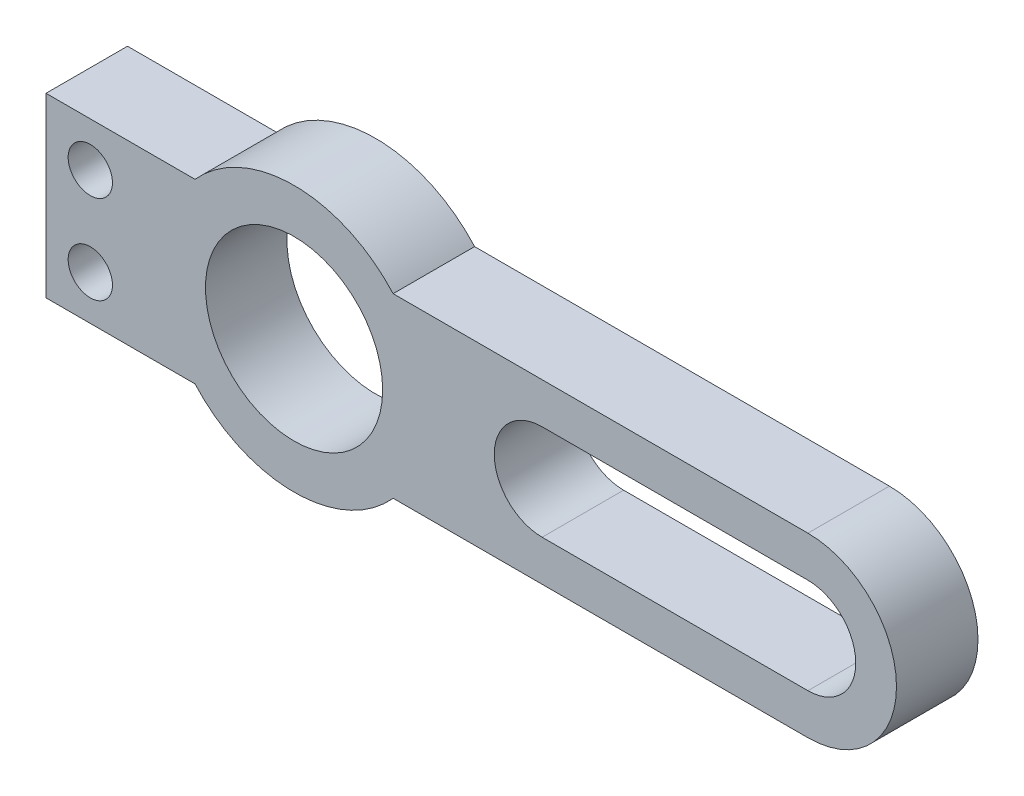
ISO-10303-21;
HEADER;
FILE_DESCRIPTION(('STEP AP214'),'2;1');
FILE_NAME('part.step','',(''),(''),'','','');
FILE_SCHEMA(('AUTOMOTIVE_DESIGN { 1 0 10303 214 1 1 1 1 }'));
ENDSEC;
DATA;
#1=APPLICATION_CONTEXT('core data for automotive mechanical design processes');
#2=APPLICATION_PROTOCOL_DEFINITION('international standard','automotive_design',2000,#1);
#3=PRODUCT_CONTEXT('',#1,'mechanical');
#4=PRODUCT('Part','Part','',(#3));
#5=PRODUCT_RELATED_PRODUCT_CATEGORY('part','',(#4));
#6=PRODUCT_DEFINITION_FORMATION('','',#4);
#7=PRODUCT_DEFINITION_CONTEXT('part definition',#1,'design');
#8=PRODUCT_DEFINITION('design','',#6,#7);
#9=PRODUCT_DEFINITION_SHAPE('','',#8);
#10=(LENGTH_UNIT() NAMED_UNIT(*) SI_UNIT(.MILLI.,.METRE.));
#11=(NAMED_UNIT(*) PLANE_ANGLE_UNIT() SI_UNIT($,.RADIAN.));
#12=(NAMED_UNIT(*) SI_UNIT($,.STERADIAN.) SOLID_ANGLE_UNIT());
#13=UNCERTAINTY_MEASURE_WITH_UNIT(LENGTH_MEASURE(1.E-05),#10,'distance_accuracy_value','');
#14=(GEOMETRIC_REPRESENTATION_CONTEXT(3) GLOBAL_UNCERTAINTY_ASSIGNED_CONTEXT((#13)) GLOBAL_UNIT_ASSIGNED_CONTEXT((#10,
#11,#12)) REPRESENTATION_CONTEXT('',''));
#15=CARTESIAN_POINT('',(0.,0.,0.));
#16=DIRECTION('',(0.,0.,1.));
#17=DIRECTION('',(1.,0.,0.));
#18=AXIS2_PLACEMENT_3D('',#15,#16,#17);
#19=CARTESIAN_POINT('',(-9.525,0.,5.842));
#20=DIRECTION('',(0.,0.,1.));
#21=DIRECTION('',(1.,0.,0.));
#22=AXIS2_PLACEMENT_3D('',#19,#20,#21);
#23=PLANE('',#22);
#24=CARTESIAN_POINT('',(-24.13,3.175,5.842));
#25=DIRECTION('',(0.,0.,1.));
#26=DIRECTION('',(1.,0.,0.));
#27=AXIS2_PLACEMENT_3D('',#24,#25,#26);
#28=CIRCLE('',#27,1.5875);
#29=CARTESIAN_POINT('',(-22.5425,3.175,5.842));
#30=VERTEX_POINT('',#29);
#31=EDGE_CURVE('E262',#30,#30,#28,.T.);
#32=ORIENTED_EDGE('',*,*,#31,.F.);
#33=EDGE_LOOP('',(#32));
#34=FACE_BOUND('',#33,.T.);
#35=CARTESIAN_POINT('',(-24.13,-3.17500000000001,5.842));
#36=DIRECTION('',(0.,0.,1.));
#37=DIRECTION('',(1.,0.,0.));
#38=AXIS2_PLACEMENT_3D('',#35,#36,#37);
#39=CIRCLE('',#38,1.5875);
#40=CARTESIAN_POINT('',(-22.5425,-3.17500000000001,5.842));
#41=VERTEX_POINT('',#40);
#42=EDGE_CURVE('E266',#41,#41,#39,.T.);
#43=ORIENTED_EDGE('',*,*,#42,.F.);
#44=EDGE_LOOP('',(#43));
#45=FACE_BOUND('',#44,.T.);
#46=DIRECTION('',(-1.,0.,0.));
#47=VECTOR('',#46,1.);
#48=CARTESIAN_POINT('',(-9.525,3.429,5.842));
#49=LINE('',#48,#47);
#50=CARTESIAN_POINT('',(27.305,3.429,5.842));
#51=VERTEX_POINT('',#50);
#52=CARTESIAN_POINT('',(8.255,3.429,5.842));
#53=VERTEX_POINT('',#52);
#54=EDGE_CURVE('E117',#51,#53,#49,.T.);
#55=ORIENTED_EDGE('',*,*,#54,.F.);
#56=CARTESIAN_POINT('',(27.305,0.,5.842));
#57=DIRECTION('',(0.,0.,1.));
#58=DIRECTION('',(1.,0.,0.));
#59=AXIS2_PLACEMENT_3D('',#56,#57,#58);
#60=CIRCLE('',#59,3.429);
#61=CARTESIAN_POINT('',(27.305,-3.429,5.842));
#62=VERTEX_POINT('',#61);
#63=EDGE_CURVE('E103',#62,#51,#60,.T.);
#64=ORIENTED_EDGE('',*,*,#63,.F.);
#65=DIRECTION('',(1.,0.,0.));
#66=VECTOR('',#65,1.);
#67=CARTESIAN_POINT('',(-9.525,-3.429,5.842));
#68=LINE('',#67,#66);
#69=CARTESIAN_POINT('',(8.255,-3.429,5.842));
#70=VERTEX_POINT('',#69);
#71=EDGE_CURVE('E59',#70,#62,#68,.T.);
#72=ORIENTED_EDGE('',*,*,#71,.F.);
#73=CARTESIAN_POINT('',(8.255,0.,5.842));
#74=DIRECTION('',(0.,0.,1.));
#75=DIRECTION('',(1.,0.,0.));
#76=AXIS2_PLACEMENT_3D('',#73,#74,#75);
#77=CIRCLE('',#76,3.429);
#78=EDGE_CURVE('E120',#53,#70,#77,.T.);
#79=ORIENTED_EDGE('',*,*,#78,.F.);
#80=EDGE_LOOP('',(#55,#64,#72,#79));
#81=FACE_BOUND('',#80,.T.);
#82=DIRECTION('',(1.,0.,0.));
#83=VECTOR('',#82,1.);
#84=CARTESIAN_POINT('',(-2.42548417143817,-6.35,5.842));
#85=LINE('',#84,#83);
#86=CARTESIAN_POINT('',(-2.42548417143817,-6.35,5.842));
#87=VERTEX_POINT('',#86);
#88=CARTESIAN_POINT('',(27.305,-6.35,5.842));
#89=VERTEX_POINT('',#88);
#90=EDGE_CURVE('E250',#87,#89,#85,.T.);
#91=ORIENTED_EDGE('',*,*,#90,.T.);
#92=CARTESIAN_POINT('',(27.305,0.,5.842));
#93=DIRECTION('',(0.,0.,1.));
#94=DIRECTION('',(1.,0.,0.));
#95=AXIS2_PLACEMENT_3D('',#92,#93,#94);
#96=CIRCLE('',#95,6.35);
#97=CARTESIAN_POINT('',(27.305,6.35,5.842));
#98=VERTEX_POINT('',#97);
#99=EDGE_CURVE('E108',#89,#98,#96,.T.);
#100=ORIENTED_EDGE('',*,*,#99,.T.);
#101=DIRECTION('',(-1.,0.,0.));
#102=VECTOR('',#101,1.);
#103=CARTESIAN_POINT('',(-2.42548417143817,6.35,5.842));
#104=LINE('',#103,#102);
#105=CARTESIAN_POINT('',(-2.42548417143817,6.35,5.842));
#106=VERTEX_POINT('',#105);
#107=EDGE_CURVE('E245',#98,#106,#104,.T.);
#108=ORIENTED_EDGE('',*,*,#107,.T.);
#109=CARTESIAN_POINT('',(-9.525,0.,5.842));
#110=DIRECTION('',(0.,0.,1.));
#111=DIRECTION('',(1.,0.,0.));
#112=AXIS2_PLACEMENT_3D('',#109,#110,#111);
#113=CIRCLE('',#112,9.525);
#114=CARTESIAN_POINT('',(-16.6245158285618,6.35,5.842));
#115=VERTEX_POINT('',#114);
#116=EDGE_CURVE('E281',#106,#115,#113,.T.);
#117=ORIENTED_EDGE('',*,*,#116,.T.);
#118=DIRECTION('',(-1.,0.,0.));
#119=VECTOR('',#118,1.);
#120=CARTESIAN_POINT('',(-27.305,6.35,5.842));
#121=LINE('',#120,#119);
#122=CARTESIAN_POINT('',(-27.305,6.35,5.842));
#123=VERTEX_POINT('',#122);
#124=EDGE_CURVE('E224',#115,#123,#121,.T.);
#125=ORIENTED_EDGE('',*,*,#124,.T.);
#126=DIRECTION('',(0.,-1.,0.));
#127=VECTOR('',#126,1.);
#128=CARTESIAN_POINT('',(-27.305,-6.35,5.842));
#129=LINE('',#128,#127);
#130=CARTESIAN_POINT('',(-27.305,-6.35,5.842));
#131=VERTEX_POINT('',#130);
#132=EDGE_CURVE('E277',#123,#131,#129,.T.);
#133=ORIENTED_EDGE('',*,*,#132,.T.);
#134=DIRECTION('',(1.,0.,0.));
#135=VECTOR('',#134,1.);
#136=CARTESIAN_POINT('',(-27.305,-6.35,5.842));
#137=LINE('',#136,#135);
#138=CARTESIAN_POINT('',(-16.6245158285618,-6.35,5.842));
#139=VERTEX_POINT('',#138);
#140=EDGE_CURVE('E274',#131,#139,#137,.T.);
#141=ORIENTED_EDGE('',*,*,#140,.T.);
#142=CARTESIAN_POINT('',(-9.525,0.,5.842));
#143=DIRECTION('',(0.,0.,1.));
#144=DIRECTION('',(1.,0.,0.));
#145=AXIS2_PLACEMENT_3D('',#142,#143,#144);
#146=CIRCLE('',#145,9.525);
#147=EDGE_CURVE('E271',#139,#87,#146,.T.);
#148=ORIENTED_EDGE('',*,*,#147,.T.);
#149=EDGE_LOOP('',(#91,#100,#108,#117,#125,#133,#141,#148));
#150=FACE_BOUND('',#149,.T.);
#151=CARTESIAN_POINT('',(-9.525,0.,5.842));
#152=DIRECTION('',(0.,0.,1.));
#153=DIRECTION('',(1.,0.,0.));
#154=AXIS2_PLACEMENT_3D('',#151,#152,#153);
#155=CIRCLE('',#154,6.35);
#156=CARTESIAN_POINT('',(-3.175,0.,5.842));
#157=VERTEX_POINT('',#156);
#158=EDGE_CURVE('E126',#157,#157,#155,.T.);
#159=ORIENTED_EDGE('',*,*,#158,.F.);
#160=EDGE_LOOP('',(#159));
#161=FACE_BOUND('',#160,.T.);
#162=ADVANCED_FACE('F40',(#34,#45,#81,#150,#161),#23,.T.);
#163=CARTESIAN_POINT('',(-9.525,0.,0.));
#164=DIRECTION('',(0.,0.,1.));
#165=DIRECTION('',(1.,0.,0.));
#166=AXIS2_PLACEMENT_3D('',#163,#164,#165);
#167=PLANE('',#166);
#168=CARTESIAN_POINT('',(-24.13,3.175,0.));
#169=DIRECTION('',(0.,0.,1.));
#170=DIRECTION('',(1.,0.,0.));
#171=AXIS2_PLACEMENT_3D('',#168,#169,#170);
#172=CIRCLE('',#171,1.5875);
#173=CARTESIAN_POINT('',(-22.5425,3.175,0.));
#174=VERTEX_POINT('',#173);
#175=EDGE_CURVE('E95',#174,#174,#172,.T.);
#176=ORIENTED_EDGE('',*,*,#175,.T.);
#177=EDGE_LOOP('',(#176));
#178=FACE_BOUND('',#177,.T.);
#179=CARTESIAN_POINT('',(-24.13,-3.17500000000001,0.));
#180=DIRECTION('',(0.,0.,1.));
#181=DIRECTION('',(1.,0.,0.));
#182=AXIS2_PLACEMENT_3D('',#179,#180,#181);
#183=CIRCLE('',#182,1.5875);
#184=CARTESIAN_POINT('',(-22.5425,-3.17500000000001,0.));
#185=VERTEX_POINT('',#184);
#186=EDGE_CURVE('E265',#185,#185,#183,.T.);
#187=ORIENTED_EDGE('',*,*,#186,.T.);
#188=EDGE_LOOP('',(#187));
#189=FACE_BOUND('',#188,.T.);
#190=DIRECTION('',(-1.,0.,0.));
#191=VECTOR('',#190,1.);
#192=CARTESIAN_POINT('',(-2.42548417143817,6.35,0.));
#193=LINE('',#192,#191);
#194=CARTESIAN_POINT('',(27.305,6.35,0.));
#195=VERTEX_POINT('',#194);
#196=CARTESIAN_POINT('',(-2.42548417143817,6.35,0.));
#197=VERTEX_POINT('',#196);
#198=EDGE_CURVE('E218',#195,#197,#193,.T.);
#199=ORIENTED_EDGE('',*,*,#198,.F.);
#200=CARTESIAN_POINT('',(27.305,0.,0.));
#201=DIRECTION('',(0.,0.,1.));
#202=DIRECTION('',(1.,0.,0.));
#203=AXIS2_PLACEMENT_3D('',#200,#201,#202);
#204=CIRCLE('',#203,6.35);
#205=CARTESIAN_POINT('',(27.305,-6.35,0.));
#206=VERTEX_POINT('',#205);
#207=EDGE_CURVE('E107',#195,#206,#204,.F.);
#208=ORIENTED_EDGE('',*,*,#207,.T.);
#209=DIRECTION('',(1.,0.,0.));
#210=VECTOR('',#209,1.);
#211=CARTESIAN_POINT('',(-2.42548417143817,-6.35,0.));
#212=LINE('',#211,#210);
#213=CARTESIAN_POINT('',(-2.42548417143817,-6.35,0.));
#214=VERTEX_POINT('',#213);
#215=EDGE_CURVE('E242',#214,#206,#212,.T.);
#216=ORIENTED_EDGE('',*,*,#215,.F.);
#217=CARTESIAN_POINT('',(-9.525,0.,0.));
#218=DIRECTION('',(0.,0.,1.));
#219=DIRECTION('',(1.,0.,0.));
#220=AXIS2_PLACEMENT_3D('',#217,#218,#219);
#221=CIRCLE('',#220,9.525);
#222=CARTESIAN_POINT('',(-16.6245158285618,-6.35,0.));
#223=VERTEX_POINT('',#222);
#224=EDGE_CURVE('E239',#223,#214,#221,.T.);
#225=ORIENTED_EDGE('',*,*,#224,.F.);
#226=DIRECTION('',(1.,0.,0.));
#227=VECTOR('',#226,1.);
#228=CARTESIAN_POINT('',(-27.305,-6.35,0.));
#229=LINE('',#228,#227);
#230=CARTESIAN_POINT('',(-27.305,-6.35,0.));
#231=VERTEX_POINT('',#230);
#232=EDGE_CURVE('E233',#231,#223,#229,.T.);
#233=ORIENTED_EDGE('',*,*,#232,.F.);
#234=DIRECTION('',(0.,-1.,0.));
#235=VECTOR('',#234,1.);
#236=CARTESIAN_POINT('',(-27.305,-6.35,0.));
#237=LINE('',#236,#235);
#238=CARTESIAN_POINT('',(-27.305,6.35,0.));
#239=VERTEX_POINT('',#238);
#240=EDGE_CURVE('E231',#239,#231,#237,.T.);
#241=ORIENTED_EDGE('',*,*,#240,.F.);
#242=DIRECTION('',(-1.,0.,0.));
#243=VECTOR('',#242,1.);
#244=CARTESIAN_POINT('',(-27.305,6.35,0.));
#245=LINE('',#244,#243);
#246=CARTESIAN_POINT('',(-16.6245158285618,6.35,0.));
#247=VERTEX_POINT('',#246);
#248=EDGE_CURVE('E217',#247,#239,#245,.T.);
#249=ORIENTED_EDGE('',*,*,#248,.F.);
#250=CARTESIAN_POINT('',(-9.525,0.,0.));
#251=DIRECTION('',(0.,0.,1.));
#252=DIRECTION('',(1.,0.,0.));
#253=AXIS2_PLACEMENT_3D('',#250,#251,#252);
#254=CIRCLE('',#253,9.525);
#255=EDGE_CURVE('E204',#197,#247,#254,.T.);
#256=ORIENTED_EDGE('',*,*,#255,.F.);
#257=EDGE_LOOP('',(#199,#208,#216,#225,#233,#241,#249,#256));
#258=FACE_BOUND('',#257,.T.);
#259=CARTESIAN_POINT('',(-9.525,0.,0.));
#260=DIRECTION('',(0.,0.,1.));
#261=DIRECTION('',(1.,0.,0.));
#262=AXIS2_PLACEMENT_3D('',#259,#260,#261);
#263=CIRCLE('',#262,6.35);
#264=CARTESIAN_POINT('',(-3.175,0.,0.));
#265=VERTEX_POINT('',#264);
#266=EDGE_CURVE('E111',#265,#265,#263,.T.);
#267=ORIENTED_EDGE('',*,*,#266,.T.);
#268=EDGE_LOOP('',(#267));
#269=FACE_BOUND('',#268,.T.);
#270=CARTESIAN_POINT('',(27.305,0.,0.));
#271=DIRECTION('',(0.,0.,1.));
#272=DIRECTION('',(1.,0.,0.));
#273=AXIS2_PLACEMENT_3D('',#270,#271,#272);
#274=CIRCLE('',#273,3.429);
#275=CARTESIAN_POINT('',(27.305,3.429,0.));
#276=VERTEX_POINT('',#275);
#277=CARTESIAN_POINT('',(27.305,-3.429,0.));
#278=VERTEX_POINT('',#277);
#279=EDGE_CURVE('E101',#276,#278,#274,.F.);
#280=ORIENTED_EDGE('',*,*,#279,.F.);
#281=DIRECTION('',(1.,0.,0.));
#282=VECTOR('',#281,1.);
#283=CARTESIAN_POINT('',(8.255,3.429,0.));
#284=LINE('',#283,#282);
#285=CARTESIAN_POINT('',(8.255,3.429,0.));
#286=VERTEX_POINT('',#285);
#287=EDGE_CURVE('E119',#286,#276,#284,.T.);
#288=ORIENTED_EDGE('',*,*,#287,.F.);
#289=CARTESIAN_POINT('',(8.255,0.,0.));
#290=DIRECTION('',(0.,0.,1.));
#291=DIRECTION('',(1.,0.,0.));
#292=AXIS2_PLACEMENT_3D('',#289,#290,#291);
#293=CIRCLE('',#292,3.429);
#294=CARTESIAN_POINT('',(8.255,-3.429,0.));
#295=VERTEX_POINT('',#294);
#296=EDGE_CURVE('E102',#295,#286,#293,.F.);
#297=ORIENTED_EDGE('',*,*,#296,.F.);
#298=DIRECTION('',(-1.,0.,0.));
#299=VECTOR('',#298,1.);
#300=CARTESIAN_POINT('',(8.255,-3.429,0.));
#301=LINE('',#300,#299);
#302=EDGE_CURVE('E44',#278,#295,#301,.T.);
#303=ORIENTED_EDGE('',*,*,#302,.F.);
#304=EDGE_LOOP('',(#280,#288,#297,#303));
#305=FACE_BOUND('',#304,.T.);
#306=ADVANCED_FACE('F99',(#178,#189,#258,#269,#305),#167,.F.);
#307=CARTESIAN_POINT('',(-2.42548417143817,6.35,6.35));
#308=DIRECTION('',(0.,-1.,0.));
#309=DIRECTION('',(0.,0.,-1.));
#310=AXIS2_PLACEMENT_3D('',#307,#308,#309);
#311=PLANE('',#310);
#312=ORIENTED_EDGE('',*,*,#198,.T.);
#313=DIRECTION('',(0.,0.,-1.));
#314=VECTOR('',#313,1.);
#315=CARTESIAN_POINT('',(-2.42548417143817,6.35,6.35));
#316=LINE('',#315,#314);
#317=EDGE_CURVE('E13',#106,#197,#316,.T.);
#318=ORIENTED_EDGE('',*,*,#317,.F.);
#319=ORIENTED_EDGE('',*,*,#107,.F.);
#320=DIRECTION('',(0.,0.,-1.));
#321=VECTOR('',#320,1.);
#322=CARTESIAN_POINT('',(27.305,6.35,6.35));
#323=LINE('',#322,#321);
#324=EDGE_CURVE('E246',#98,#195,#323,.T.);
#325=ORIENTED_EDGE('',*,*,#324,.T.);
#326=EDGE_LOOP('',(#312,#318,#319,#325));
#327=FACE_BOUND('',#326,.T.);
#328=ADVANCED_FACE('F150',(#327),#311,.F.);
#329=CARTESIAN_POINT('',(-9.525,0.,6.35));
#330=DIRECTION('',(0.,0.,-1.));
#331=DIRECTION('',(-1.,0.,0.));
#332=AXIS2_PLACEMENT_3D('',#329,#330,#331);
#333=CYLINDRICAL_SURFACE('',#332,9.525);
#334=ORIENTED_EDGE('',*,*,#255,.T.);
#335=DIRECTION('',(0.,0.,-1.));
#336=VECTOR('',#335,1.);
#337=CARTESIAN_POINT('',(-16.6245158285618,6.35,6.35));
#338=LINE('',#337,#336);
#339=EDGE_CURVE('E50',#115,#247,#338,.T.);
#340=ORIENTED_EDGE('',*,*,#339,.F.);
#341=ORIENTED_EDGE('',*,*,#116,.F.);
#342=ORIENTED_EDGE('',*,*,#317,.T.);
#343=EDGE_LOOP('',(#334,#340,#341,#342));
#344=FACE_BOUND('',#343,.T.);
#345=ADVANCED_FACE('F192',(#344),#333,.T.);
#346=CARTESIAN_POINT('',(-27.305,6.35,6.35));
#347=DIRECTION('',(0.,-1.,0.));
#348=DIRECTION('',(0.,0.,-1.));
#349=AXIS2_PLACEMENT_3D('',#346,#347,#348);
#350=PLANE('',#349);
#351=ORIENTED_EDGE('',*,*,#248,.T.);
#352=DIRECTION('',(0.,0.,-1.));
#353=VECTOR('',#352,1.);
#354=CARTESIAN_POINT('',(-27.305,6.35,6.35));
#355=LINE('',#354,#353);
#356=EDGE_CURVE('E225',#123,#239,#355,.T.);
#357=ORIENTED_EDGE('',*,*,#356,.F.);
#358=ORIENTED_EDGE('',*,*,#124,.F.);
#359=ORIENTED_EDGE('',*,*,#339,.T.);
#360=EDGE_LOOP('',(#351,#357,#358,#359));
#361=FACE_BOUND('',#360,.T.);
#362=ADVANCED_FACE('F189',(#361),#350,.F.);
#363=CARTESIAN_POINT('',(-27.305,-6.35,6.35));
#364=DIRECTION('',(1.,0.,0.));
#365=DIRECTION('',(0.,0.,-1.));
#366=AXIS2_PLACEMENT_3D('',#363,#364,#365);
#367=PLANE('',#366);
#368=ORIENTED_EDGE('',*,*,#240,.T.);
#369=DIRECTION('',(0.,0.,-1.));
#370=VECTOR('',#369,1.);
#371=CARTESIAN_POINT('',(-27.305,-6.35,6.35));
#372=LINE('',#371,#370);
#373=EDGE_CURVE('E258',#131,#231,#372,.T.);
#374=ORIENTED_EDGE('',*,*,#373,.F.);
#375=ORIENTED_EDGE('',*,*,#132,.F.);
#376=ORIENTED_EDGE('',*,*,#356,.T.);
#377=EDGE_LOOP('',(#368,#374,#375,#376));
#378=FACE_BOUND('',#377,.T.);
#379=ADVANCED_FACE('F185',(#378),#367,.F.);
#380=CARTESIAN_POINT('',(-27.305,-6.35,6.35));
#381=DIRECTION('',(0.,1.,0.));
#382=DIRECTION('',(0.,0.,1.));
#383=AXIS2_PLACEMENT_3D('',#380,#381,#382);
#384=PLANE('',#383);
#385=ORIENTED_EDGE('',*,*,#232,.T.);
#386=DIRECTION('',(0.,0.,-1.));
#387=VECTOR('',#386,1.);
#388=CARTESIAN_POINT('',(-16.6245158285618,-6.35,6.35));
#389=LINE('',#388,#387);
#390=EDGE_CURVE('E255',#139,#223,#389,.T.);
#391=ORIENTED_EDGE('',*,*,#390,.F.);
#392=ORIENTED_EDGE('',*,*,#140,.F.);
#393=ORIENTED_EDGE('',*,*,#373,.T.);
#394=EDGE_LOOP('',(#385,#391,#392,#393));
#395=FACE_BOUND('',#394,.T.);
#396=ADVANCED_FACE('F181',(#395),#384,.F.);
#397=CARTESIAN_POINT('',(-9.525,0.,6.35));
#398=DIRECTION('',(0.,0.,-1.));
#399=DIRECTION('',(-1.,0.,0.));
#400=AXIS2_PLACEMENT_3D('',#397,#398,#399);
#401=CYLINDRICAL_SURFACE('',#400,9.525);
#402=ORIENTED_EDGE('',*,*,#224,.T.);
#403=DIRECTION('',(0.,0.,-1.));
#404=VECTOR('',#403,1.);
#405=CARTESIAN_POINT('',(-2.42548417143817,-6.35,6.35));
#406=LINE('',#405,#404);
#407=EDGE_CURVE('E252',#87,#214,#406,.T.);
#408=ORIENTED_EDGE('',*,*,#407,.F.);
#409=ORIENTED_EDGE('',*,*,#147,.F.);
#410=ORIENTED_EDGE('',*,*,#390,.T.);
#411=EDGE_LOOP('',(#402,#408,#409,#410));
#412=FACE_BOUND('',#411,.T.);
#413=ADVANCED_FACE('F177',(#412),#401,.T.);
#414=CARTESIAN_POINT('',(-2.42548417143817,-6.35,6.35));
#415=DIRECTION('',(0.,1.,0.));
#416=DIRECTION('',(0.,0.,1.));
#417=AXIS2_PLACEMENT_3D('',#414,#415,#416);
#418=PLANE('',#417);
#419=ORIENTED_EDGE('',*,*,#215,.T.);
#420=DIRECTION('',(0.,0.,-1.));
#421=VECTOR('',#420,1.);
#422=CARTESIAN_POINT('',(27.305,-6.35,6.35));
#423=LINE('',#422,#421);
#424=EDGE_CURVE('E249',#89,#206,#423,.T.);
#425=ORIENTED_EDGE('',*,*,#424,.F.);
#426=ORIENTED_EDGE('',*,*,#90,.F.);
#427=ORIENTED_EDGE('',*,*,#407,.T.);
#428=EDGE_LOOP('',(#419,#425,#426,#427));
#429=FACE_BOUND('',#428,.T.);
#430=ADVANCED_FACE('F168',(#429),#418,.F.);
#431=CARTESIAN_POINT('',(-9.525,0.,6.35));
#432=DIRECTION('',(0.,0.,-1.));
#433=DIRECTION('',(-1.,0.,0.));
#434=AXIS2_PLACEMENT_3D('',#431,#432,#433);
#435=CYLINDRICAL_SURFACE('',#434,6.35);
#436=ORIENTED_EDGE('',*,*,#158,.T.);
#437=EDGE_LOOP('',(#436));
#438=FACE_BOUND('',#437,.T.);
#439=ORIENTED_EDGE('',*,*,#266,.F.);
#440=EDGE_LOOP('',(#439));
#441=FACE_BOUND('',#440,.T.);
#442=ADVANCED_FACE('F162',(#438,#441),#435,.F.);
#443=CARTESIAN_POINT('',(27.305,0.,-17.9605122421383));
#444=DIRECTION('',(0.,0.,1.));
#445=DIRECTION('',(1.,0.,0.));
#446=AXIS2_PLACEMENT_3D('',#443,#444,#445);
#447=CYLINDRICAL_SURFACE('',#446,6.35);
#448=ORIENTED_EDGE('',*,*,#424,.T.);
#449=ORIENTED_EDGE('',*,*,#207,.F.);
#450=ORIENTED_EDGE('',*,*,#324,.F.);
#451=ORIENTED_EDGE('',*,*,#99,.F.);
#452=EDGE_LOOP('',(#448,#449,#450,#451));
#453=FACE_BOUND('',#452,.T.);
#454=ADVANCED_FACE('F158',(#453),#447,.T.);
#455=CARTESIAN_POINT('',(27.305,0.,-17.9605122421383));
#456=DIRECTION('',(0.,0.,1.));
#457=DIRECTION('',(1.,0.,0.));
#458=AXIS2_PLACEMENT_3D('',#455,#456,#457);
#459=CYLINDRICAL_SURFACE('',#458,3.429);
#460=ORIENTED_EDGE('',*,*,#63,.T.);
#461=DIRECTION('',(0.,0.,1.));
#462=VECTOR('',#461,1.);
#463=CARTESIAN_POINT('',(27.305,3.429,-0.00100000000000013));
#464=LINE('',#463,#462);
#465=EDGE_CURVE('E94',#276,#51,#464,.T.);
#466=ORIENTED_EDGE('',*,*,#465,.F.);
#467=ORIENTED_EDGE('',*,*,#279,.T.);
#468=DIRECTION('',(0.,0.,1.));
#469=VECTOR('',#468,1.);
#470=CARTESIAN_POINT('',(27.305,-3.429,-17.9605122421383));
#471=LINE('',#470,#469);
#472=EDGE_CURVE('E87',#278,#62,#471,.T.);
#473=ORIENTED_EDGE('',*,*,#472,.T.);
#474=EDGE_LOOP('',(#460,#466,#467,#473));
#475=FACE_BOUND('',#474,.T.);
#476=ADVANCED_FACE('F106',(#475),#459,.F.);
#477=CARTESIAN_POINT('',(8.255,0.,-0.00100000000000013));
#478=DIRECTION('',(0.,0.,1.));
#479=DIRECTION('',(1.,0.,0.));
#480=AXIS2_PLACEMENT_3D('',#477,#478,#479);
#481=CYLINDRICAL_SURFACE('',#480,3.429);
#482=ORIENTED_EDGE('',*,*,#296,.T.);
#483=DIRECTION('',(0.,0.,1.));
#484=VECTOR('',#483,1.);
#485=CARTESIAN_POINT('',(8.255,3.429,-0.00100000000000013));
#486=LINE('',#485,#484);
#487=EDGE_CURVE('E104',#286,#53,#486,.T.);
#488=ORIENTED_EDGE('',*,*,#487,.T.);
#489=ORIENTED_EDGE('',*,*,#78,.T.);
#490=DIRECTION('',(0.,0.,-1.));
#491=VECTOR('',#490,1.);
#492=CARTESIAN_POINT('',(8.255,-3.429,-0.00100000000000013));
#493=LINE('',#492,#491);
#494=EDGE_CURVE('E85',#295,#70,#493,.F.);
#495=ORIENTED_EDGE('',*,*,#494,.F.);
#496=EDGE_LOOP('',(#482,#488,#489,#495));
#497=FACE_BOUND('',#496,.T.);
#498=ADVANCED_FACE('F132',(#497),#481,.F.);
#499=CARTESIAN_POINT('',(8.255,3.429,-0.00100000000000013));
#500=DIRECTION('',(0.,1.,0.));
#501=DIRECTION('',(0.,0.,1.));
#502=AXIS2_PLACEMENT_3D('',#499,#500,#501);
#503=PLANE('',#502);
#504=ORIENTED_EDGE('',*,*,#287,.T.);
#505=ORIENTED_EDGE('',*,*,#465,.T.);
#506=ORIENTED_EDGE('',*,*,#54,.T.);
#507=ORIENTED_EDGE('',*,*,#487,.F.);
#508=EDGE_LOOP('',(#504,#505,#506,#507));
#509=FACE_BOUND('',#508,.T.);
#510=ADVANCED_FACE('F135',(#509),#503,.F.);
#511=CARTESIAN_POINT('',(8.255,-3.429,-0.00100000000000013));
#512=DIRECTION('',(0.,-1.,0.));
#513=DIRECTION('',(0.,0.,-1.));
#514=AXIS2_PLACEMENT_3D('',#511,#512,#513);
#515=PLANE('',#514);
#516=ORIENTED_EDGE('',*,*,#302,.T.);
#517=ORIENTED_EDGE('',*,*,#494,.T.);
#518=ORIENTED_EDGE('',*,*,#71,.T.);
#519=ORIENTED_EDGE('',*,*,#472,.F.);
#520=EDGE_LOOP('',(#516,#517,#518,#519));
#521=FACE_BOUND('',#520,.T.);
#522=ADVANCED_FACE('F42',(#521),#515,.F.);
#523=CARTESIAN_POINT('',(-24.13,-3.17500000000001,0.));
#524=DIRECTION('',(0.,0.,1.));
#525=DIRECTION('',(1.,0.,0.));
#526=AXIS2_PLACEMENT_3D('',#523,#524,#525);
#527=CYLINDRICAL_SURFACE('',#526,1.5875);
#528=ORIENTED_EDGE('',*,*,#186,.F.);
#529=EDGE_LOOP('',(#528));
#530=FACE_BOUND('',#529,.T.);
#531=ORIENTED_EDGE('',*,*,#42,.T.);
#532=EDGE_LOOP('',(#531));
#533=FACE_BOUND('',#532,.T.);
#534=ADVANCED_FACE('F142',(#530,#533),#527,.F.);
#535=CARTESIAN_POINT('',(-24.13,3.175,0.));
#536=DIRECTION('',(0.,0.,1.));
#537=DIRECTION('',(1.,0.,0.));
#538=AXIS2_PLACEMENT_3D('',#535,#536,#537);
#539=CYLINDRICAL_SURFACE('',#538,1.5875);
#540=ORIENTED_EDGE('',*,*,#175,.F.);
#541=EDGE_LOOP('',(#540));
#542=FACE_BOUND('',#541,.T.);
#543=ORIENTED_EDGE('',*,*,#31,.T.);
#544=EDGE_LOOP('',(#543));
#545=FACE_BOUND('',#544,.T.);
#546=ADVANCED_FACE('F303',(#542,#545),#539,.F.);
#547=CLOSED_SHELL('',(#162,#306,#328,#345,#362,#379,#396,#413,#430,#442,#454,#476,#498,#510,
#522,#534,#546));
#548=MANIFOLD_SOLID_BREP('B2',#547);
#549=ADVANCED_BREP_SHAPE_REPRESENTATION('',(#18,#548),#14);
#550=SHAPE_DEFINITION_REPRESENTATION(#9,#549);
ENDSEC;
END-ISO-10303-21;
